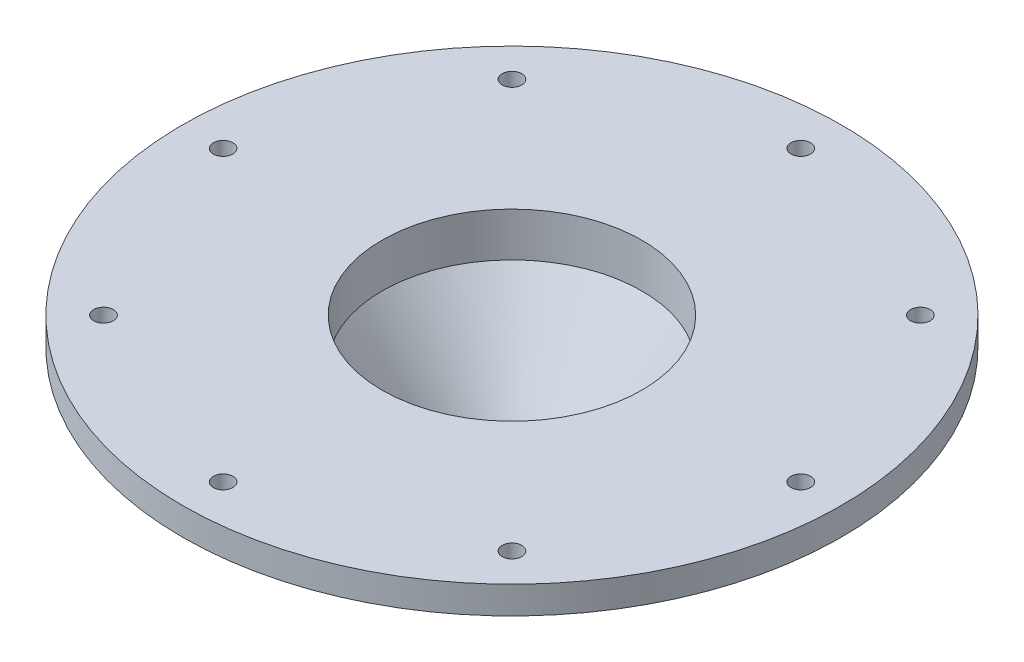
ISO-10303-21;
HEADER;
FILE_DESCRIPTION(('STEP AP214'),'2;1');
FILE_NAME('part.step','',(''),(''),'','','');
FILE_SCHEMA(('AUTOMOTIVE_DESIGN { 1 0 10303 214 1 1 1 1 }'));
ENDSEC;
DATA;
#1=APPLICATION_CONTEXT('core data for automotive mechanical design processes');
#2=APPLICATION_PROTOCOL_DEFINITION('international standard','automotive_design',2000,#1);
#3=PRODUCT_CONTEXT('',#1,'mechanical');
#4=PRODUCT('Part','Part','',(#3));
#5=PRODUCT_RELATED_PRODUCT_CATEGORY('part','',(#4));
#6=PRODUCT_DEFINITION_FORMATION('','',#4);
#7=PRODUCT_DEFINITION_CONTEXT('part definition',#1,'design');
#8=PRODUCT_DEFINITION('design','',#6,#7);
#9=PRODUCT_DEFINITION_SHAPE('','',#8);
#10=(LENGTH_UNIT() NAMED_UNIT(*) SI_UNIT(.MILLI.,.METRE.));
#11=(NAMED_UNIT(*) PLANE_ANGLE_UNIT() SI_UNIT($,.RADIAN.));
#12=(NAMED_UNIT(*) SI_UNIT($,.STERADIAN.) SOLID_ANGLE_UNIT());
#13=UNCERTAINTY_MEASURE_WITH_UNIT(LENGTH_MEASURE(1.E-05),#10,'distance_accuracy_value','');
#14=(GEOMETRIC_REPRESENTATION_CONTEXT(3) GLOBAL_UNCERTAINTY_ASSIGNED_CONTEXT((#13)) GLOBAL_UNIT_ASSIGNED_CONTEXT((#10,
#11,#12)) REPRESENTATION_CONTEXT('',''));
#15=CARTESIAN_POINT('',(0.,0.,0.));
#16=DIRECTION('',(0.,0.,1.));
#17=DIRECTION('',(1.,0.,0.));
#18=AXIS2_PLACEMENT_3D('',#15,#16,#17);
#19=CARTESIAN_POINT('',(0.,-19.05,0.));
#20=DIRECTION('',(0.,-1.,0.));
#21=DIRECTION('',(0.,0.,-1.));
#22=AXIS2_PLACEMENT_3D('',#19,#20,#21);
#23=PLANE('',#22);
#24=CARTESIAN_POINT('',(0.,-19.05,0.));
#25=DIRECTION('',(0.,-1.,0.));
#26=DIRECTION('',(0.,0.,-1.));
#27=AXIS2_PLACEMENT_3D('',#24,#25,#26);
#28=CIRCLE('',#27,5.);
#29=CARTESIAN_POINT('',(0.,-19.05,-5.));
#30=VERTEX_POINT('',#29);
#31=EDGE_CURVE('E60',#30,#30,#28,.T.);
#32=ORIENTED_EDGE('',*,*,#31,.F.);
#33=EDGE_LOOP('',(#32));
#34=FACE_BOUND('',#33,.T.);
#35=CARTESIAN_POINT('',(0.,-19.05,0.));
#36=DIRECTION('',(0.,1.,0.));
#37=DIRECTION('',(-1.,0.,0.));
#38=AXIS2_PLACEMENT_3D('',#35,#36,#37);
#39=CIRCLE('',#38,8.41515202607263);
#40=CARTESIAN_POINT('',(-8.41515202607263,-19.05,0.));
#41=VERTEX_POINT('',#40);
#42=EDGE_CURVE('E170',#41,#41,#39,.T.);
#43=ORIENTED_EDGE('',*,*,#42,.F.);
#44=EDGE_LOOP('',(#43));
#45=FACE_BOUND('',#44,.T.);
#46=ADVANCED_FACE('F41',(#34,#45),#23,.T.);
#47=CARTESIAN_POINT('',(0.,3.175,0.));
#48=DIRECTION('',(0.,-1.,0.));
#49=DIRECTION('',(0.,0.,-1.));
#50=AXIS2_PLACEMENT_3D('',#47,#48,#49);
#51=CYLINDRICAL_SURFACE('',#50,5.);
#52=CARTESIAN_POINT('',(0.,-15.875,0.));
#53=DIRECTION('',(0.,-1.,0.));
#54=DIRECTION('',(0.,0.,-1.));
#55=AXIS2_PLACEMENT_3D('',#52,#53,#54);
#56=CIRCLE('',#55,5.);
#57=CARTESIAN_POINT('',(-1.36585362623204,-15.875,4.80982784221107));
#58=VERTEX_POINT('',#57);
#59=EDGE_CURVE('E69',#58,#58,#56,.T.);
#60=ORIENTED_EDGE('',*,*,#59,.F.);
#61=EDGE_LOOP('',(#60));
#62=FACE_BOUND('',#61,.T.);
#63=ORIENTED_EDGE('',*,*,#31,.T.);
#64=EDGE_LOOP('',(#63));
#65=FACE_BOUND('',#64,.T.);
#66=ADVANCED_FACE('F75',(#62,#65),#51,.F.);
#67=CARTESIAN_POINT('',(0.,0.,0.));
#68=DIRECTION('',(0.,1.,0.));
#69=DIRECTION('',(0.,0.,1.));
#70=AXIS2_PLACEMENT_3D('',#67,#68,#69);
#71=PLANE('',#70);
#72=CARTESIAN_POINT('',(-23.5731723178062,0.,23.5731723178068));
#73=DIRECTION('',(0.,-1.,0.));
#74=DIRECTION('',(0.,0.,-1.));
#75=AXIS2_PLACEMENT_3D('',#72,#73,#74);
#76=CIRCLE('',#75,1.13029999999999);
#77=CARTESIAN_POINT('',(-23.5731723178062,0.,22.4428723178068));
#78=VERTEX_POINT('',#77);
#79=EDGE_CURVE('E63',#78,#78,#76,.T.);
#80=ORIENTED_EDGE('',*,*,#79,.F.);
#81=EDGE_LOOP('',(#80));
#82=FACE_BOUND('',#81,.T.);
#83=CARTESIAN_POINT('',(-33.3375,0.,3.49191777401049E-13));
#84=DIRECTION('',(0.,-1.,0.));
#85=DIRECTION('',(0.,0.,-1.));
#86=AXIS2_PLACEMENT_3D('',#83,#84,#85);
#87=CIRCLE('',#86,1.13029999999999);
#88=CARTESIAN_POINT('',(-33.3375,0.,-1.13029999999964));
#89=VERTEX_POINT('',#88);
#90=EDGE_CURVE('E139',#89,#89,#87,.T.);
#91=ORIENTED_EDGE('',*,*,#90,.F.);
#92=EDGE_LOOP('',(#91));
#93=FACE_BOUND('',#92,.T.);
#94=CARTESIAN_POINT('',(0.,0.,-33.3375));
#95=DIRECTION('',(0.,-1.,0.));
#96=DIRECTION('',(0.,0.,-1.));
#97=AXIS2_PLACEMENT_3D('',#94,#95,#96);
#98=CIRCLE('',#97,1.13029999999999);
#99=CARTESIAN_POINT('',(0.,0.,-34.4678));
#100=VERTEX_POINT('',#99);
#101=EDGE_CURVE('E143',#100,#100,#98,.T.);
#102=ORIENTED_EDGE('',*,*,#101,.F.);
#103=EDGE_LOOP('',(#102));
#104=FACE_BOUND('',#103,.T.);
#105=CARTESIAN_POINT('',(23.5731723178064,0.,-23.5731723178067));
#106=DIRECTION('',(0.,-1.,0.));
#107=DIRECTION('',(0.,0.,-1.));
#108=AXIS2_PLACEMENT_3D('',#105,#106,#107);
#109=CIRCLE('',#108,1.13029999999999);
#110=CARTESIAN_POINT('',(23.5731723178064,0.,-24.7034723178066));
#111=VERTEX_POINT('',#110);
#112=EDGE_CURVE('E147',#111,#111,#109,.T.);
#113=ORIENTED_EDGE('',*,*,#112,.F.);
#114=EDGE_LOOP('',(#113));
#115=FACE_BOUND('',#114,.T.);
#116=CARTESIAN_POINT('',(33.3375,0.,-1.16397259133683E-13));
#117=DIRECTION('',(0.,-1.,0.));
#118=DIRECTION('',(0.,0.,-1.));
#119=AXIS2_PLACEMENT_3D('',#116,#117,#118);
#120=CIRCLE('',#119,1.13029999999999);
#121=CARTESIAN_POINT('',(33.3375,0.,-1.1303000000001));
#122=VERTEX_POINT('',#121);
#123=EDGE_CURVE('E151',#122,#122,#120,.T.);
#124=ORIENTED_EDGE('',*,*,#123,.F.);
#125=EDGE_LOOP('',(#124));
#126=FACE_BOUND('',#125,.T.);
#127=CARTESIAN_POINT('',(23.5731723178066,0.,23.5731723178065));
#128=DIRECTION('',(0.,-1.,0.));
#129=DIRECTION('',(0.,0.,-1.));
#130=AXIS2_PLACEMENT_3D('',#127,#128,#129);
#131=CIRCLE('',#130,1.13029999999999);
#132=CARTESIAN_POINT('',(23.5731723178066,0.,22.4428723178065));
#133=VERTEX_POINT('',#132);
#134=EDGE_CURVE('E155',#133,#133,#131,.T.);
#135=ORIENTED_EDGE('',*,*,#134,.F.);
#136=EDGE_LOOP('',(#135));
#137=FACE_BOUND('',#136,.T.);
#138=CARTESIAN_POINT('',(0.,0.,33.3375));
#139=DIRECTION('',(0.,-1.,0.));
#140=DIRECTION('',(0.,0.,-1.));
#141=AXIS2_PLACEMENT_3D('',#138,#139,#140);
#142=CIRCLE('',#141,1.13029999999999);
#143=CARTESIAN_POINT('',(0.,0.,32.2072));
#144=VERTEX_POINT('',#143);
#145=EDGE_CURVE('E159',#144,#144,#142,.T.);
#146=ORIENTED_EDGE('',*,*,#145,.F.);
#147=EDGE_LOOP('',(#146));
#148=FACE_BOUND('',#147,.T.);
#149=CARTESIAN_POINT('',(0.,0.,0.));
#150=DIRECTION('',(0.,1.,0.));
#151=DIRECTION('',(0.,0.,1.));
#152=AXIS2_PLACEMENT_3D('',#149,#150,#151);
#153=CIRCLE('',#152,38.04031);
#154=CARTESIAN_POINT('',(0.,0.,38.04031));
#155=VERTEX_POINT('',#154);
#156=EDGE_CURVE('E50',#155,#155,#153,.T.);
#157=ORIENTED_EDGE('',*,*,#156,.F.);
#158=EDGE_LOOP('',(#157));
#159=FACE_BOUND('',#158,.T.);
#160=CARTESIAN_POINT('',(-23.5731723178067,0.,-23.5731723178063));
#161=DIRECTION('',(0.,-1.,0.));
#162=DIRECTION('',(0.,0.,-1.));
#163=AXIS2_PLACEMENT_3D('',#160,#161,#162);
#164=CIRCLE('',#163,1.13029999999999);
#165=CARTESIAN_POINT('',(-23.5731723178067,0.,-24.7034723178063));
#166=VERTEX_POINT('',#165);
#167=EDGE_CURVE('E165',#166,#166,#164,.T.);
#168=ORIENTED_EDGE('',*,*,#167,.F.);
#169=EDGE_LOOP('',(#168));
#170=FACE_BOUND('',#169,.T.);
#171=CARTESIAN_POINT('',(0.,0.,0.));
#172=DIRECTION('',(0.,1.,0.));
#173=DIRECTION('',(-1.,0.,0.));
#174=AXIS2_PLACEMENT_3D('',#171,#172,#173);
#175=CIRCLE('',#174,24.4);
#176=CARTESIAN_POINT('',(-24.4,0.,0.));
#177=VERTEX_POINT('',#176);
#178=EDGE_CURVE('E168',#177,#177,#175,.T.);
#179=ORIENTED_EDGE('',*,*,#178,.T.);
#180=EDGE_LOOP('',(#179));
#181=FACE_BOUND('',#180,.T.);
#182=ADVANCED_FACE('F85',(#82,#93,#104,#115,#126,#137,#148,#159,#170,#181),#71,.F.);
#183=CARTESIAN_POINT('',(0.,3.175,0.));
#184=DIRECTION('',(0.,-1.,0.));
#185=DIRECTION('',(0.,0.,-1.));
#186=AXIS2_PLACEMENT_3D('',#183,#184,#185);
#187=CYLINDRICAL_SURFACE('',#186,38.04031);
#188=CARTESIAN_POINT('',(0.,3.175,0.));
#189=DIRECTION('',(0.,1.,0.));
#190=DIRECTION('',(0.,0.,1.));
#191=AXIS2_PLACEMENT_3D('',#188,#189,#190);
#192=CIRCLE('',#191,38.04031);
#193=CARTESIAN_POINT('',(0.,3.175,38.04031));
#194=VERTEX_POINT('',#193);
#195=EDGE_CURVE('E11',#194,#194,#192,.T.);
#196=ORIENTED_EDGE('',*,*,#195,.F.);
#197=EDGE_LOOP('',(#196));
#198=FACE_BOUND('',#197,.T.);
#199=ORIENTED_EDGE('',*,*,#156,.T.);
#200=EDGE_LOOP('',(#199));
#201=FACE_BOUND('',#200,.T.);
#202=ADVANCED_FACE('F43',(#198,#201),#187,.T.);
#203=CARTESIAN_POINT('',(0.,3.175,0.));
#204=DIRECTION('',(0.,1.,0.));
#205=DIRECTION('',(0.,0.,1.));
#206=AXIS2_PLACEMENT_3D('',#203,#204,#205);
#207=PLANE('',#206);
#208=CARTESIAN_POINT('',(0.,3.175,0.));
#209=DIRECTION('',(0.,1.,0.));
#210=DIRECTION('',(0.,0.,1.));
#211=AXIS2_PLACEMENT_3D('',#208,#209,#210);
#212=CIRCLE('',#211,15.);
#213=CARTESIAN_POINT('',(0.,3.175,15.));
#214=VERTEX_POINT('',#213);
#215=EDGE_CURVE('E64',#214,#214,#212,.T.);
#216=ORIENTED_EDGE('',*,*,#215,.F.);
#217=EDGE_LOOP('',(#216));
#218=FACE_BOUND('',#217,.T.);
#219=CARTESIAN_POINT('',(-23.5731723178062,3.175,23.5731723178068));
#220=DIRECTION('',(0.,-1.,0.));
#221=DIRECTION('',(0.,0.,-1.));
#222=AXIS2_PLACEMENT_3D('',#219,#220,#221);
#223=CIRCLE('',#222,1.1303);
#224=CARTESIAN_POINT('',(-23.5731723178062,3.175,22.4428723178068));
#225=VERTEX_POINT('',#224);
#226=EDGE_CURVE('E215',#225,#225,#223,.T.);
#227=ORIENTED_EDGE('',*,*,#226,.T.);
#228=EDGE_LOOP('',(#227));
#229=FACE_BOUND('',#228,.T.);
#230=CARTESIAN_POINT('',(-33.3375,3.175,3.49191777401049E-13));
#231=DIRECTION('',(0.,-1.,0.));
#232=DIRECTION('',(0.,0.,-1.));
#233=AXIS2_PLACEMENT_3D('',#230,#231,#232);
#234=CIRCLE('',#233,1.1303);
#235=CARTESIAN_POINT('',(-33.3375,3.175,-1.13029999999965));
#236=VERTEX_POINT('',#235);
#237=EDGE_CURVE('E219',#236,#236,#234,.T.);
#238=ORIENTED_EDGE('',*,*,#237,.T.);
#239=EDGE_LOOP('',(#238));
#240=FACE_BOUND('',#239,.T.);
#241=CARTESIAN_POINT('',(-23.5731723178067,3.175,-23.5731723178063));
#242=DIRECTION('',(0.,-1.,0.));
#243=DIRECTION('',(0.,0.,-1.));
#244=AXIS2_PLACEMENT_3D('',#241,#242,#243);
#245=CIRCLE('',#244,1.1303);
#246=CARTESIAN_POINT('',(-23.5731723178067,3.175,-24.7034723178063));
#247=VERTEX_POINT('',#246);
#248=EDGE_CURVE('E223',#247,#247,#245,.T.);
#249=ORIENTED_EDGE('',*,*,#248,.T.);
#250=EDGE_LOOP('',(#249));
#251=FACE_BOUND('',#250,.T.);
#252=CARTESIAN_POINT('',(0.,3.175,-33.3375));
#253=DIRECTION('',(0.,-1.,0.));
#254=DIRECTION('',(0.,0.,-1.));
#255=AXIS2_PLACEMENT_3D('',#252,#253,#254);
#256=CIRCLE('',#255,1.1303);
#257=CARTESIAN_POINT('',(0.,3.175,-34.4678));
#258=VERTEX_POINT('',#257);
#259=EDGE_CURVE('E227',#258,#258,#256,.T.);
#260=ORIENTED_EDGE('',*,*,#259,.T.);
#261=EDGE_LOOP('',(#260));
#262=FACE_BOUND('',#261,.T.);
#263=CARTESIAN_POINT('',(23.5731723178064,3.175,-23.5731723178067));
#264=DIRECTION('',(0.,-1.,0.));
#265=DIRECTION('',(0.,0.,-1.));
#266=AXIS2_PLACEMENT_3D('',#263,#264,#265);
#267=CIRCLE('',#266,1.1303);
#268=CARTESIAN_POINT('',(23.5731723178064,3.175,-24.7034723178067));
#269=VERTEX_POINT('',#268);
#270=EDGE_CURVE('E231',#269,#269,#267,.T.);
#271=ORIENTED_EDGE('',*,*,#270,.T.);
#272=EDGE_LOOP('',(#271));
#273=FACE_BOUND('',#272,.T.);
#274=CARTESIAN_POINT('',(33.3375,3.175,-1.16397259133683E-13));
#275=DIRECTION('',(0.,-1.,0.));
#276=DIRECTION('',(0.,0.,-1.));
#277=AXIS2_PLACEMENT_3D('',#274,#275,#276);
#278=CIRCLE('',#277,1.1303);
#279=CARTESIAN_POINT('',(33.3375,3.175,-1.13030000000012));
#280=VERTEX_POINT('',#279);
#281=EDGE_CURVE('E235',#280,#280,#278,.T.);
#282=ORIENTED_EDGE('',*,*,#281,.T.);
#283=EDGE_LOOP('',(#282));
#284=FACE_BOUND('',#283,.T.);
#285=CARTESIAN_POINT('',(23.5731723178066,3.175,23.5731723178065));
#286=DIRECTION('',(0.,-1.,0.));
#287=DIRECTION('',(0.,0.,-1.));
#288=AXIS2_PLACEMENT_3D('',#285,#286,#287);
#289=CIRCLE('',#288,1.1303);
#290=CARTESIAN_POINT('',(23.5731723178066,3.175,22.4428723178065));
#291=VERTEX_POINT('',#290);
#292=EDGE_CURVE('E239',#291,#291,#289,.T.);
#293=ORIENTED_EDGE('',*,*,#292,.T.);
#294=EDGE_LOOP('',(#293));
#295=FACE_BOUND('',#294,.T.);
#296=CARTESIAN_POINT('',(0.,3.175,33.3375));
#297=DIRECTION('',(0.,-1.,0.));
#298=DIRECTION('',(0.,0.,-1.));
#299=AXIS2_PLACEMENT_3D('',#296,#297,#298);
#300=CIRCLE('',#299,1.1303);
#301=CARTESIAN_POINT('',(0.,3.175,32.2072));
#302=VERTEX_POINT('',#301);
#303=EDGE_CURVE('E55',#302,#302,#300,.T.);
#304=ORIENTED_EDGE('',*,*,#303,.T.);
#305=EDGE_LOOP('',(#304));
#306=FACE_BOUND('',#305,.T.);
#307=ORIENTED_EDGE('',*,*,#195,.T.);
#308=EDGE_LOOP('',(#307));
#309=FACE_BOUND('',#308,.T.);
#310=ADVANCED_FACE('F123',(#218,#229,#240,#251,#262,#273,#284,#295,#306,#309),#207,.T.);
#311=CARTESIAN_POINT('',(0.,0.,33.3375));
#312=DIRECTION('',(0.,-1.,0.));
#313=DIRECTION('',(0.,0.,-1.));
#314=AXIS2_PLACEMENT_3D('',#311,#312,#313);
#315=CYLINDRICAL_SURFACE('',#314,1.13029999999999);
#316=ORIENTED_EDGE('',*,*,#303,.F.);
#317=EDGE_LOOP('',(#316));
#318=FACE_BOUND('',#317,.T.);
#319=ORIENTED_EDGE('',*,*,#145,.T.);
#320=EDGE_LOOP('',(#319));
#321=FACE_BOUND('',#320,.T.);
#322=ADVANCED_FACE('F119',(#318,#321),#315,.F.);
#323=CARTESIAN_POINT('',(23.5731723178066,0.,23.5731723178065));
#324=DIRECTION('',(0.,-1.,0.));
#325=DIRECTION('',(0.,0.,-1.));
#326=AXIS2_PLACEMENT_3D('',#323,#324,#325);
#327=CYLINDRICAL_SURFACE('',#326,1.13029999999999);
#328=ORIENTED_EDGE('',*,*,#292,.F.);
#329=EDGE_LOOP('',(#328));
#330=FACE_BOUND('',#329,.T.);
#331=ORIENTED_EDGE('',*,*,#134,.T.);
#332=EDGE_LOOP('',(#331));
#333=FACE_BOUND('',#332,.T.);
#334=ADVANCED_FACE('F115',(#330,#333),#327,.F.);
#335=CARTESIAN_POINT('',(33.3375,0.,-1.16397259133683E-13));
#336=DIRECTION('',(0.,-1.,0.));
#337=DIRECTION('',(0.,0.,-1.));
#338=AXIS2_PLACEMENT_3D('',#335,#336,#337);
#339=CYLINDRICAL_SURFACE('',#338,1.13029999999999);
#340=ORIENTED_EDGE('',*,*,#281,.F.);
#341=EDGE_LOOP('',(#340));
#342=FACE_BOUND('',#341,.T.);
#343=ORIENTED_EDGE('',*,*,#123,.T.);
#344=EDGE_LOOP('',(#343));
#345=FACE_BOUND('',#344,.T.);
#346=ADVANCED_FACE('F111',(#342,#345),#339,.F.);
#347=CARTESIAN_POINT('',(23.5731723178064,0.,-23.5731723178067));
#348=DIRECTION('',(0.,-1.,0.));
#349=DIRECTION('',(0.,0.,-1.));
#350=AXIS2_PLACEMENT_3D('',#347,#348,#349);
#351=CYLINDRICAL_SURFACE('',#350,1.13029999999999);
#352=ORIENTED_EDGE('',*,*,#270,.F.);
#353=EDGE_LOOP('',(#352));
#354=FACE_BOUND('',#353,.T.);
#355=ORIENTED_EDGE('',*,*,#112,.T.);
#356=EDGE_LOOP('',(#355));
#357=FACE_BOUND('',#356,.T.);
#358=ADVANCED_FACE('F107',(#354,#357),#351,.F.);
#359=CARTESIAN_POINT('',(0.,0.,-33.3375));
#360=DIRECTION('',(0.,-1.,0.));
#361=DIRECTION('',(0.,0.,-1.));
#362=AXIS2_PLACEMENT_3D('',#359,#360,#361);
#363=CYLINDRICAL_SURFACE('',#362,1.13029999999999);
#364=ORIENTED_EDGE('',*,*,#259,.F.);
#365=EDGE_LOOP('',(#364));
#366=FACE_BOUND('',#365,.T.);
#367=ORIENTED_EDGE('',*,*,#101,.T.);
#368=EDGE_LOOP('',(#367));
#369=FACE_BOUND('',#368,.T.);
#370=ADVANCED_FACE('F103',(#366,#369),#363,.F.);
#371=CARTESIAN_POINT('',(-23.5731723178067,0.,-23.5731723178063));
#372=DIRECTION('',(0.,-1.,0.));
#373=DIRECTION('',(0.,0.,-1.));
#374=AXIS2_PLACEMENT_3D('',#371,#372,#373);
#375=CYLINDRICAL_SURFACE('',#374,1.13029999999999);
#376=ORIENTED_EDGE('',*,*,#248,.F.);
#377=EDGE_LOOP('',(#376));
#378=FACE_BOUND('',#377,.T.);
#379=ORIENTED_EDGE('',*,*,#167,.T.);
#380=EDGE_LOOP('',(#379));
#381=FACE_BOUND('',#380,.T.);
#382=ADVANCED_FACE('F99',(#378,#381),#375,.F.);
#383=CARTESIAN_POINT('',(-33.3375,0.,3.49191777401049E-13));
#384=DIRECTION('',(0.,-1.,0.));
#385=DIRECTION('',(0.,0.,-1.));
#386=AXIS2_PLACEMENT_3D('',#383,#384,#385);
#387=CYLINDRICAL_SURFACE('',#386,1.13029999999999);
#388=ORIENTED_EDGE('',*,*,#237,.F.);
#389=EDGE_LOOP('',(#388));
#390=FACE_BOUND('',#389,.T.);
#391=ORIENTED_EDGE('',*,*,#90,.T.);
#392=EDGE_LOOP('',(#391));
#393=FACE_BOUND('',#392,.T.);
#394=ADVANCED_FACE('F95',(#390,#393),#387,.F.);
#395=CARTESIAN_POINT('',(-23.5731723178062,0.,23.5731723178068));
#396=DIRECTION('',(0.,-1.,0.));
#397=DIRECTION('',(0.,0.,-1.));
#398=AXIS2_PLACEMENT_3D('',#395,#396,#397);
#399=CYLINDRICAL_SURFACE('',#398,1.13029999999999);
#400=ORIENTED_EDGE('',*,*,#226,.F.);
#401=EDGE_LOOP('',(#400));
#402=FACE_BOUND('',#401,.T.);
#403=ORIENTED_EDGE('',*,*,#79,.T.);
#404=EDGE_LOOP('',(#403));
#405=FACE_BOUND('',#404,.T.);
#406=ADVANCED_FACE('F92',(#402,#405),#399,.F.);
#407=CARTESIAN_POINT('',(0.,-1.905,0.));
#408=DIRECTION('',(0.,1.,0.));
#409=DIRECTION('',(0.,0.,1.));
#410=AXIS2_PLACEMENT_3D('',#407,#408,#409);
#411=CYLINDRICAL_SURFACE('',#410,15.);
#412=CARTESIAN_POINT('',(0.,-1.905,0.));
#413=DIRECTION('',(0.,1.,0.));
#414=DIRECTION('',(0.,0.,1.));
#415=AXIS2_PLACEMENT_3D('',#412,#413,#414);
#416=CIRCLE('',#415,15.);
#417=CARTESIAN_POINT('',(0.,-1.905,15.));
#418=VERTEX_POINT('',#417);
#419=EDGE_CURVE('E45',#418,#418,#416,.T.);
#420=ORIENTED_EDGE('',*,*,#419,.F.);
#421=EDGE_LOOP('',(#420));
#422=FACE_BOUND('',#421,.T.);
#423=ORIENTED_EDGE('',*,*,#215,.T.);
#424=EDGE_LOOP('',(#423));
#425=FACE_BOUND('',#424,.T.);
#426=ADVANCED_FACE('F86',(#422,#425),#411,.F.);
#427=CARTESIAN_POINT('',(0.,-1.905,15.));
#428=CARTESIAN_POINT('',(-1.36585362623204,-15.875,4.80982784221107));
#429=CARTESIAN_POINT('',(-30.,-1.905,15.));
#430=CARTESIAN_POINT('',(-10.9855093106542,-15.875,2.07812058974699));
#431=CARTESIAN_POINT('',(-30.,-1.905,-15.));
#432=CARTESIAN_POINT('',(-8.2538020581901,-15.875,-7.54153509467515));
#433=CARTESIAN_POINT('',(0.,-1.905,-15.));
#434=CARTESIAN_POINT('',(1.36585362623204,-15.875,-4.80982784221107));
#435=CARTESIAN_POINT('',(30.,-1.905,-15.));
#436=CARTESIAN_POINT('',(10.9855093106542,-15.875,-2.07812058974699));
#437=CARTESIAN_POINT('',(30.,-1.905,15.));
#438=CARTESIAN_POINT('',(8.2538020581901,-15.875,7.54153509467515));
#439=CARTESIAN_POINT('',(0.,-1.905,15.));
#440=CARTESIAN_POINT('',(-1.36585362623204,-15.875,4.80982784221107));
#441=(BOUNDED_SURFACE() B_SPLINE_SURFACE(3,1,((#427,#428),(#429,#430),(#431,#432),(#433,#434),
(#435,#436),(#437,#438),(#439,#440)),.UNSPECIFIED.,.T.,.F.,.F.) B_SPLINE_SURFACE_WITH_KNOTS((4,
3,4),(2,2),(0.,0.5,1.),(0.,1.),
.UNSPECIFIED.) GEOMETRIC_REPRESENTATION_ITEM() RATIONAL_B_SPLINE_SURFACE(((1.,1.),
(0.333333333333333,0.333333333333333),(0.333333333333333,0.333333333333333),(1.,1.),
(0.333333333333333,0.333333333333333),(0.333333333333333,0.333333333333333),(1.,1.))) REPRESENTATION_ITEM('') SURFACE());
#442=CARTESIAN_POINT('',(0.,-1.905,15.));
#443=CARTESIAN_POINT('',(-0.0142276419399171,-2.05052083333333,14.8938523733564));
#444=CARTESIAN_POINT('',(-0.0284552838798341,-2.19604166666667,14.7877047467127));
#445=CARTESIAN_POINT('',(-0.0569105677596682,-2.48708333333333,14.5754094934255));
#446=CARTESIAN_POINT('',(-0.0711382096995853,-2.63260416666667,14.4692618667818));
#447=CARTESIAN_POINT('',(-0.0995934935794194,-2.92364583333333,14.2569666134946));
#448=CARTESIAN_POINT('',(-0.113821135519336,-3.06916666666667,14.1508189868509));
#449=CARTESIAN_POINT('',(-0.142276419399171,-3.36020833333333,13.9385237335637));
#450=CARTESIAN_POINT('',(-0.156504061339088,-3.50572916666667,13.83237610692));
#451=CARTESIAN_POINT('',(-0.184959345218922,-3.79677083333333,13.6200808536327));
#452=CARTESIAN_POINT('',(-0.199186987158839,-3.94229166666667,13.5139332269891));
#453=CARTESIAN_POINT('',(-0.227642271038673,-4.23333333333333,13.3016379737018));
#454=CARTESIAN_POINT('',(-0.24186991297859,-4.37885416666667,13.1954903470582));
#455=CARTESIAN_POINT('',(-0.270325196858424,-4.66989583333333,12.9831950937709));
#456=CARTESIAN_POINT('',(-0.284552838798341,-4.81541666666667,12.8770474671273));
#457=CARTESIAN_POINT('',(-0.313008122678175,-5.10645833333333,12.66475221384));
#458=CARTESIAN_POINT('',(-0.327235764618092,-5.25197916666667,12.5586045871964));
#459=CARTESIAN_POINT('',(-0.355691048497926,-5.54302083333333,12.3463093339091));
#460=CARTESIAN_POINT('',(-0.369918690437843,-5.68854166666667,12.2401617072655));
#461=CARTESIAN_POINT('',(-0.398373974317678,-5.97958333333333,12.0278664539782));
#462=CARTESIAN_POINT('',(-0.412601616257595,-6.12510416666667,11.9217188273346));
#463=CARTESIAN_POINT('',(-0.441056900137429,-6.41614583333333,11.7094235740473));
#464=CARTESIAN_POINT('',(-0.455284542077346,-6.56166666666667,11.6032759474037));
#465=CARTESIAN_POINT('',(-0.48373982595718,-6.85270833333333,11.3909806941164));
#466=CARTESIAN_POINT('',(-0.497967467897097,-6.99822916666667,11.2848330674728));
#467=CARTESIAN_POINT('',(-0.526422751776931,-7.28927083333333,11.0725378141855));
#468=CARTESIAN_POINT('',(-0.540650393716848,-7.43479166666667,10.9663901875419));
#469=CARTESIAN_POINT('',(-0.569105677596682,-7.72583333333333,10.7540949342546));
#470=CARTESIAN_POINT('',(-0.583333319536599,-7.87135416666667,10.647947307611));
#471=CARTESIAN_POINT('',(-0.611788603416433,-8.16239583333333,10.4356520543237));
#472=CARTESIAN_POINT('',(-0.626016245356351,-8.30791666666667,10.3295044276801));
#473=CARTESIAN_POINT('',(-0.654471529236185,-8.59895833333333,10.1172091743928));
#474=CARTESIAN_POINT('',(-0.668699171176102,-8.74447916666667,10.0110615477492));
#475=CARTESIAN_POINT('',(-0.697154455055936,-9.03552083333333,9.7987662944619));
#476=CARTESIAN_POINT('',(-0.711382096995853,-9.18104166666667,9.69261866781827));
#477=CARTESIAN_POINT('',(-0.739837380875687,-9.47208333333333,9.48032341453099));
#478=CARTESIAN_POINT('',(-0.754065022815604,-9.61760416666667,9.37417578788736));
#479=CARTESIAN_POINT('',(-0.782520306695438,-9.90864583333333,9.16188053460009));
#480=CARTESIAN_POINT('',(-0.796747948635355,-10.0541666666667,9.05573290795646));
#481=CARTESIAN_POINT('',(-0.825203232515189,-10.3452083333333,8.84343765466919));
#482=CARTESIAN_POINT('',(-0.839430874455106,-10.4907291666667,8.73729002802555));
#483=CARTESIAN_POINT('',(-0.867886158334941,-10.7817708333333,8.52499477473828));
#484=CARTESIAN_POINT('',(-0.882113800274858,-10.9272916666667,8.41884714809465));
#485=CARTESIAN_POINT('',(-0.910569084154692,-11.2183333333333,8.20655189480738));
#486=CARTESIAN_POINT('',(-0.924796726094609,-11.3638541666667,8.10040426816374));
#487=CARTESIAN_POINT('',(-0.953252009974443,-11.6548958333333,7.88810901487648));
#488=CARTESIAN_POINT('',(-0.96747965191436,-11.8004166666667,7.78196138823284));
#489=CARTESIAN_POINT('',(-0.995934935794194,-12.0914583333333,7.56966613494557));
#490=CARTESIAN_POINT('',(-1.01016257773411,-12.2369791666667,7.46351850830194));
#491=CARTESIAN_POINT('',(-1.03861786161395,-12.5280208333333,7.25122325501467));
#492=CARTESIAN_POINT('',(-1.05284550355386,-12.6735416666667,7.14507562837103));
#493=CARTESIAN_POINT('',(-1.0813007874337,-12.9645833333333,6.93278037508376));
#494=CARTESIAN_POINT('',(-1.09552842937361,-13.1101041666667,6.82663274844013));
#495=CARTESIAN_POINT('',(-1.12398371325345,-13.4011458333333,6.61433749515286));
#496=CARTESIAN_POINT('',(-1.13821135519336,-13.5466666666667,6.50818986850923));
#497=CARTESIAN_POINT('',(-1.1666666390732,-13.8377083333333,6.29589461522196));
#498=CARTESIAN_POINT('',(-1.18089428101312,-13.9832291666667,6.18974698857832));
#499=CARTESIAN_POINT('',(-1.20934956489295,-14.2742708333333,5.97745173529105));
#500=CARTESIAN_POINT('',(-1.22357720683287,-14.4197916666667,5.87130410864742));
#501=CARTESIAN_POINT('',(-1.2520324907127,-14.7108333333333,5.65900885536015));
#502=CARTESIAN_POINT('',(-1.26626013265262,-14.8563541666667,5.55286122871651));
#503=CARTESIAN_POINT('',(-1.29471541653245,-15.1473958333333,5.34056597542924));
#504=CARTESIAN_POINT('',(-1.30894305847237,-15.2929166666667,5.23441834878561));
#505=CARTESIAN_POINT('',(-1.3373983423522,-15.5839583333333,5.02212309549834));
#506=CARTESIAN_POINT('',(-1.35162598429212,-15.7294791666667,4.9159754688547));
#507=CARTESIAN_POINT('',(-1.36585362623204,-15.875,4.80982784221107));
#508=B_SPLINE_CURVE_WITH_KNOTS('',3,(#442,#443,#444,#445,#446,#447,#448,#449,#450,#451,#452,
#453,#454,#455,#456,#457,#458,#459,#460,#461,#462,#463,#464,#465,#466,#467,#468,#469,#470,#471,
#472,#473,#474,#475,#476,#477,#478,#479,#480,#481,#482,#483,#484,#485,#486,#487,#488,#489,#490,
#491,#492,#493,#494,#495,#496,#497,#498,#499,#500,#501,#502,#503,#504,#505,#506,#507),
.UNSPECIFIED.,.F.,.F.,(4,2,2,2,2,2,2,2,2,2,2,2,2,2,2,2,2,2,2,2,2,2,2,2,2,2,2,2,2,2,2,2,4),(0.,
0.542046599787761,1.08409319957552,1.62613979936328,2.16818639915104,2.7102329989388,
3.25227959872656,3.79432619851432,4.33637279830208,4.87841939808984,5.42046599787761,
5.96251259766536,6.50455919745313,7.04660579724089,7.58865239702865,8.13069899681641,
8.67274559660417,9.21479219639193,9.75683879617969,10.2988853959674,10.8409319957552,
11.382978595543,11.9250251953307,12.4670717951185,13.0091183949063,13.551164994694,
14.0932115944818,14.6352581942695,15.1773047940573,15.7193513938451,16.2613979936328,
16.8034445934206,17.3454911932083),.UNSPECIFIED.);
#509=EDGE_CURVE('BSEAM182',#418,#58,#508,.T.);
#510=ORIENTED_EDGE('',*,*,#419,.T.);
#511=ORIENTED_EDGE('',*,*,#59,.T.);
#512=ORIENTED_EDGE('',*,*,#509,.T.);
#513=ORIENTED_EDGE('',*,*,#509,.F.);
#514=EDGE_LOOP('',(#510,#512,#511,#513));
#515=FACE_BOUND('',#514,.T.);
#516=ADVANCED_FACE('F182',(#515),#441,.F.);
#517=CARTESIAN_POINT('',(0.,0.,0.));
#518=DIRECTION('',(0.,1.,0.));
#519=DIRECTION('',(-1.,0.,0.));
#520=AXIS2_PLACEMENT_3D('',#517,#518,#519);
#521=CONICAL_SURFACE('',#520,24.4,0.698131700797738);
#522=ORIENTED_EDGE('',*,*,#42,.T.);
#523=EDGE_LOOP('',(#522));
#524=FACE_BOUND('',#523,.T.);
#525=ORIENTED_EDGE('',*,*,#178,.F.);
#526=EDGE_LOOP('',(#525));
#527=FACE_BOUND('',#526,.T.);
#528=ADVANCED_FACE('F193',(#524,#527),#521,.T.);
#529=CLOSED_SHELL('',(#46,#66,#182,#202,#310,#322,#334,#346,#358,#370,#382,#394,#406,#426,#516,#528));
#530=MANIFOLD_SOLID_BREP('B2',#529);
#531=ADVANCED_BREP_SHAPE_REPRESENTATION('',(#18,#530),#14);
#532=SHAPE_DEFINITION_REPRESENTATION(#9,#531);
ENDSEC;
END-ISO-10303-21;
